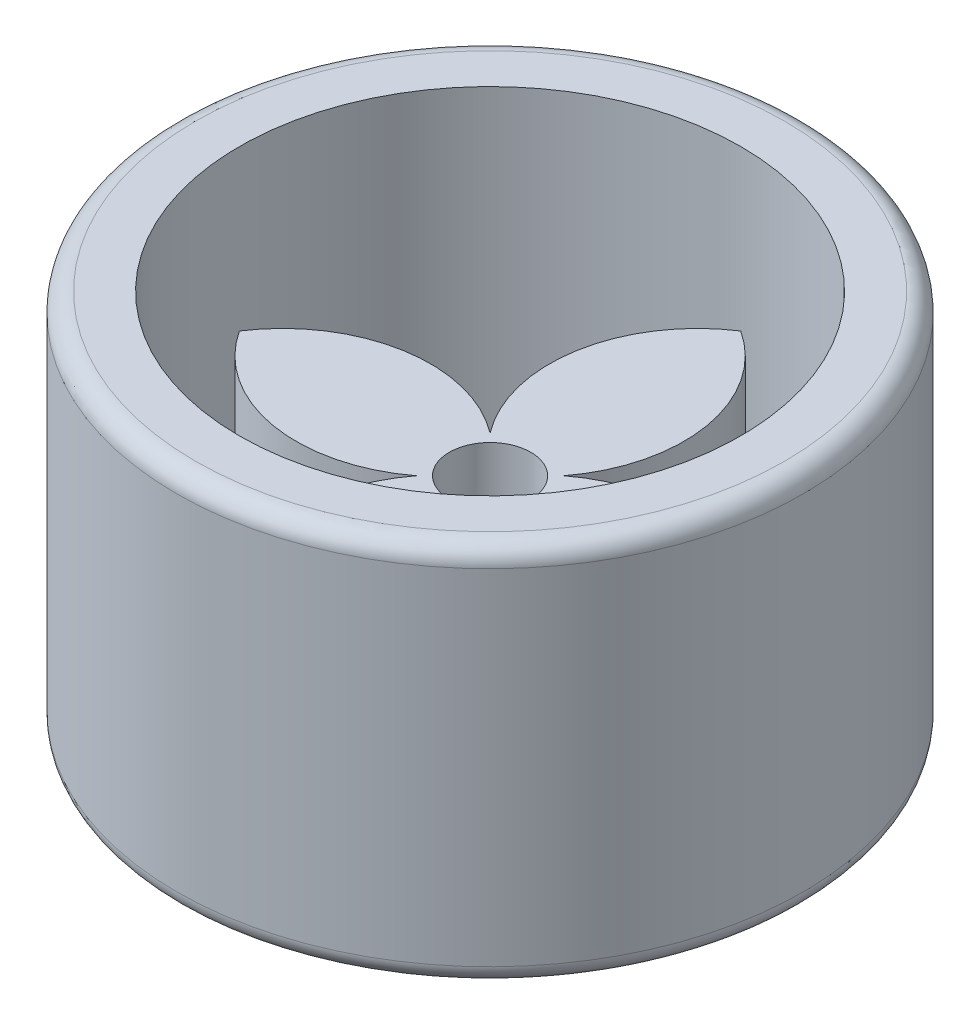
ISO-10303-21;
HEADER;
FILE_DESCRIPTION(('STEP AP214'),'2;1');
FILE_NAME('part.step','',(''),(''),'','','');
FILE_SCHEMA(('AUTOMOTIVE_DESIGN { 1 0 10303 214 1 1 1 1 }'));
ENDSEC;
DATA;
#1=APPLICATION_CONTEXT('core data for automotive mechanical design processes');
#2=APPLICATION_PROTOCOL_DEFINITION('international standard','automotive_design',2000,#1);
#3=PRODUCT_CONTEXT('',#1,'mechanical');
#4=PRODUCT('Part','Part','',(#3));
#5=PRODUCT_RELATED_PRODUCT_CATEGORY('part','',(#4));
#6=PRODUCT_DEFINITION_FORMATION('','',#4);
#7=PRODUCT_DEFINITION_CONTEXT('part definition',#1,'design');
#8=PRODUCT_DEFINITION('design','',#6,#7);
#9=PRODUCT_DEFINITION_SHAPE('','',#8);
#10=(LENGTH_UNIT() NAMED_UNIT(*) SI_UNIT(.MILLI.,.METRE.));
#11=(NAMED_UNIT(*) PLANE_ANGLE_UNIT() SI_UNIT($,.RADIAN.));
#12=(NAMED_UNIT(*) SI_UNIT($,.STERADIAN.) SOLID_ANGLE_UNIT());
#13=UNCERTAINTY_MEASURE_WITH_UNIT(LENGTH_MEASURE(1.E-05),#10,'distance_accuracy_value','');
#14=(GEOMETRIC_REPRESENTATION_CONTEXT(3) GLOBAL_UNCERTAINTY_ASSIGNED_CONTEXT((#13)) GLOBAL_UNIT_ASSIGNED_CONTEXT((#10,
#11,#12)) REPRESENTATION_CONTEXT('',''));
#15=CARTESIAN_POINT('',(0.,0.,0.));
#16=DIRECTION('',(0.,0.,1.));
#17=DIRECTION('',(1.,0.,0.));
#18=AXIS2_PLACEMENT_3D('',#15,#16,#17);
#19=CARTESIAN_POINT('',(0.,174.137084989848,0.));
#20=DIRECTION('',(0.,-1.,0.));
#21=DIRECTION('',(0.,0.,-1.));
#22=AXIS2_PLACEMENT_3D('',#19,#20,#21);
#23=CYLINDRICAL_SURFACE('',#22,2.635);
#24=CARTESIAN_POINT('',(0.,0.,0.));
#25=DIRECTION('',(0.,1.,0.));
#26=DIRECTION('',(0.,0.,1.));
#27=AXIS2_PLACEMENT_3D('',#24,#25,#26);
#28=CIRCLE('',#27,2.635);
#29=CARTESIAN_POINT('',(0.,0.,2.635));
#30=VERTEX_POINT('',#29);
#31=EDGE_CURVE('E240',#30,#30,#28,.T.);
#32=ORIENTED_EDGE('',*,*,#31,.F.);
#33=EDGE_LOOP('',(#32));
#34=FACE_BOUND('',#33,.T.);
#35=CARTESIAN_POINT('',(0.,11.95,0.));
#36=DIRECTION('',(0.,1.,0.));
#37=DIRECTION('',(0.,0.,1.));
#38=AXIS2_PLACEMENT_3D('',#35,#36,#37);
#39=CIRCLE('',#38,2.635);
#40=CARTESIAN_POINT('',(0.,11.95,2.635));
#41=VERTEX_POINT('',#40);
#42=EDGE_CURVE('E196',#41,#41,#39,.T.);
#43=ORIENTED_EDGE('',*,*,#42,.T.);
#44=EDGE_LOOP('',(#43));
#45=FACE_BOUND('',#44,.T.);
#46=ADVANCED_FACE('F66',(#34,#45),#23,.F.);
#47=CARTESIAN_POINT('',(20.2122260111009,174.137084989848,12.8907519493418));
#48=DIRECTION('',(0.,-1.,0.));
#49=DIRECTION('',(0.,0.,-1.));
#50=AXIS2_PLACEMENT_3D('',#47,#48,#49);
#51=CYLINDRICAL_SURFACE('',#50,23.6162546830612);
#52=DIRECTION('',(0.,-1.,0.));
#53=VECTOR('',#52,1.);
#54=CARTESIAN_POINT('',(5.87703014444037,174.137084989848,-5.87703014444033));
#55=LINE('',#54,#53);
#56=CARTESIAN_POINT('',(5.87703014444037,35.5,-5.87703014444033));
#57=VERTEX_POINT('',#56);
#58=CARTESIAN_POINT('',(5.87703014444037,0.,-5.87703014444033));
#59=VERTEX_POINT('',#58);
#60=EDGE_CURVE('E267',#57,#59,#55,.T.);
#61=ORIENTED_EDGE('',*,*,#60,.F.);
#62=CARTESIAN_POINT('',(20.2122260111009,35.5,12.8907519493418));
#63=DIRECTION('',(0.,1.,0.));
#64=DIRECTION('',(0.,0.,1.));
#65=AXIS2_PLACEMENT_3D('',#62,#63,#64);
#66=CIRCLE('',#65,23.6162546830612);
#67=CARTESIAN_POINT('',(40.,35.5,0.));
#68=VERTEX_POINT('',#67);
#69=EDGE_CURVE('E235',#57,#68,#66,.F.);
#70=ORIENTED_EDGE('',*,*,#69,.T.);
#71=DIRECTION('',(0.,-1.,0.));
#72=VECTOR('',#71,1.);
#73=CARTESIAN_POINT('',(40.,174.137084989848,0.));
#74=LINE('',#73,#72);
#75=CARTESIAN_POINT('',(40.,0.,0.));
#76=VERTEX_POINT('',#75);
#77=EDGE_CURVE('E70',#68,#76,#74,.T.);
#78=ORIENTED_EDGE('',*,*,#77,.T.);
#79=CARTESIAN_POINT('',(20.2122260111009,0.,12.8907519493418));
#80=DIRECTION('',(0.,1.,0.));
#81=DIRECTION('',(0.,0.,1.));
#82=AXIS2_PLACEMENT_3D('',#79,#80,#81);
#83=CIRCLE('',#82,23.6162546830612);
#84=EDGE_CURVE('E246',#59,#76,#83,.F.);
#85=ORIENTED_EDGE('',*,*,#84,.F.);
#86=EDGE_LOOP('',(#61,#70,#78,#85));
#87=FACE_BOUND('',#86,.T.);
#88=ADVANCED_FACE('F324',(#87),#51,.T.);
#89=CARTESIAN_POINT('',(-12.8907519493418,174.137084989848,-20.2122260111009));
#90=DIRECTION('',(0.,-1.,0.));
#91=DIRECTION('',(0.,0.,-1.));
#92=AXIS2_PLACEMENT_3D('',#89,#90,#91);
#93=CYLINDRICAL_SURFACE('',#92,23.6162546830613);
#94=CARTESIAN_POINT('',(-12.8907519493418,35.5,-20.2122260111009));
#95=DIRECTION('',(0.,1.,0.));
#96=DIRECTION('',(0.,0.,1.));
#97=AXIS2_PLACEMENT_3D('',#94,#95,#96);
#98=CIRCLE('',#97,23.6162546830613);
#99=CARTESIAN_POINT('',(0.,35.5,-40.));
#100=VERTEX_POINT('',#99);
#101=EDGE_CURVE('E262',#57,#100,#98,.T.);
#102=ORIENTED_EDGE('',*,*,#101,.F.);
#103=ORIENTED_EDGE('',*,*,#60,.T.);
#104=CARTESIAN_POINT('',(-12.8907519493418,0.,-20.2122260111009));
#105=DIRECTION('',(0.,1.,0.));
#106=DIRECTION('',(0.,0.,1.));
#107=AXIS2_PLACEMENT_3D('',#104,#105,#106);
#108=CIRCLE('',#107,23.6162546830613);
#109=CARTESIAN_POINT('',(0.,0.,-40.));
#110=VERTEX_POINT('',#109);
#111=EDGE_CURVE('E263',#59,#110,#108,.T.);
#112=ORIENTED_EDGE('',*,*,#111,.T.);
#113=DIRECTION('',(0.,-1.,0.));
#114=VECTOR('',#113,1.);
#115=CARTESIAN_POINT('',(0.,174.137084989848,-40.));
#116=LINE('',#115,#114);
#117=EDGE_CURVE('E282',#100,#110,#116,.T.);
#118=ORIENTED_EDGE('',*,*,#117,.F.);
#119=EDGE_LOOP('',(#102,#103,#112,#118));
#120=FACE_BOUND('',#119,.T.);
#121=ADVANCED_FACE('F321',(#120),#93,.T.);
#122=CARTESIAN_POINT('',(12.8907519493418,174.137084989848,-20.2122260111009));
#123=DIRECTION('',(0.,-1.,0.));
#124=DIRECTION('',(0.,0.,-1.));
#125=AXIS2_PLACEMENT_3D('',#122,#123,#124);
#126=CYLINDRICAL_SURFACE('',#125,23.6162546830612);
#127=DIRECTION('',(0.,-1.,0.));
#128=VECTOR('',#127,1.);
#129=CARTESIAN_POINT('',(-5.87703014444033,174.137084989848,-5.87703014444033));
#130=LINE('',#129,#128);
#131=CARTESIAN_POINT('',(-5.87703014444033,35.5,-5.87703014444033));
#132=VERTEX_POINT('',#131);
#133=CARTESIAN_POINT('',(-5.87703014444033,0.,-5.87703014444033));
#134=VERTEX_POINT('',#133);
#135=EDGE_CURVE('E259',#132,#134,#130,.T.);
#136=ORIENTED_EDGE('',*,*,#135,.F.);
#137=CARTESIAN_POINT('',(12.8907519493418,35.5,-20.2122260111009));
#138=DIRECTION('',(0.,1.,0.));
#139=DIRECTION('',(0.,0.,1.));
#140=AXIS2_PLACEMENT_3D('',#137,#138,#139);
#141=CIRCLE('',#140,23.6162546830612);
#142=EDGE_CURVE('E266',#132,#100,#141,.F.);
#143=ORIENTED_EDGE('',*,*,#142,.T.);
#144=ORIENTED_EDGE('',*,*,#117,.T.);
#145=CARTESIAN_POINT('',(12.8907519493418,0.,-20.2122260111009));
#146=DIRECTION('',(0.,1.,0.));
#147=DIRECTION('',(0.,0.,1.));
#148=AXIS2_PLACEMENT_3D('',#145,#146,#147);
#149=CIRCLE('',#148,23.6162546830612);
#150=EDGE_CURVE('E254',#134,#110,#149,.F.);
#151=ORIENTED_EDGE('',*,*,#150,.F.);
#152=EDGE_LOOP('',(#136,#143,#144,#151));
#153=FACE_BOUND('',#152,.T.);
#154=ADVANCED_FACE('F317',(#153),#126,.T.);
#155=CARTESIAN_POINT('',(-20.2122260111009,174.137084989848,12.8907519493418));
#156=DIRECTION('',(0.,-1.,0.));
#157=DIRECTION('',(0.,0.,-1.));
#158=AXIS2_PLACEMENT_3D('',#155,#156,#157);
#159=CYLINDRICAL_SURFACE('',#158,23.6162546830612);
#160=CARTESIAN_POINT('',(-20.2122260111009,35.5,12.8907519493418));
#161=DIRECTION('',(0.,1.,0.));
#162=DIRECTION('',(0.,0.,1.));
#163=AXIS2_PLACEMENT_3D('',#160,#161,#162);
#164=CIRCLE('',#163,23.6162546830612);
#165=CARTESIAN_POINT('',(-40.,35.5,0.));
#166=VERTEX_POINT('',#165);
#167=EDGE_CURVE('E276',#132,#166,#164,.T.);
#168=ORIENTED_EDGE('',*,*,#167,.F.);
#169=ORIENTED_EDGE('',*,*,#135,.T.);
#170=CARTESIAN_POINT('',(-20.2122260111009,0.,12.8907519493418));
#171=DIRECTION('',(0.,1.,0.));
#172=DIRECTION('',(0.,0.,1.));
#173=AXIS2_PLACEMENT_3D('',#170,#171,#172);
#174=CIRCLE('',#173,23.6162546830612);
#175=CARTESIAN_POINT('',(-40.,0.,0.));
#176=VERTEX_POINT('',#175);
#177=EDGE_CURVE('E255',#134,#176,#174,.T.);
#178=ORIENTED_EDGE('',*,*,#177,.T.);
#179=DIRECTION('',(0.,-1.,0.));
#180=VECTOR('',#179,1.);
#181=CARTESIAN_POINT('',(-40.,174.137084989848,0.));
#182=LINE('',#181,#180);
#183=EDGE_CURVE('E278',#166,#176,#182,.T.);
#184=ORIENTED_EDGE('',*,*,#183,.F.);
#185=EDGE_LOOP('',(#168,#169,#178,#184));
#186=FACE_BOUND('',#185,.T.);
#187=ADVANCED_FACE('F313',(#186),#159,.T.);
#188=CARTESIAN_POINT('',(-20.2122260111009,174.137084989848,-12.8907519493418));
#189=DIRECTION('',(0.,-1.,0.));
#190=DIRECTION('',(0.,0.,-1.));
#191=AXIS2_PLACEMENT_3D('',#188,#189,#190);
#192=CYLINDRICAL_SURFACE('',#191,23.6162546830612);
#193=DIRECTION('',(0.,-1.,0.));
#194=VECTOR('',#193,1.);
#195=CARTESIAN_POINT('',(-5.87703014444032,174.137084989848,5.87703014444034));
#196=LINE('',#195,#194);
#197=CARTESIAN_POINT('',(-5.87703014444032,35.5,5.87703014444034));
#198=VERTEX_POINT('',#197);
#199=CARTESIAN_POINT('',(-5.87703014444032,0.,5.87703014444034));
#200=VERTEX_POINT('',#199);
#201=EDGE_CURVE('E251',#198,#200,#196,.T.);
#202=ORIENTED_EDGE('',*,*,#201,.F.);
#203=CARTESIAN_POINT('',(-20.2122260111009,35.5,-12.8907519493418));
#204=DIRECTION('',(0.,1.,0.));
#205=DIRECTION('',(0.,0.,1.));
#206=AXIS2_PLACEMENT_3D('',#203,#204,#205);
#207=CIRCLE('',#206,23.6162546830612);
#208=EDGE_CURVE('E258',#198,#166,#207,.F.);
#209=ORIENTED_EDGE('',*,*,#208,.T.);
#210=ORIENTED_EDGE('',*,*,#183,.T.);
#211=CARTESIAN_POINT('',(-20.2122260111009,0.,-12.8907519493418));
#212=DIRECTION('',(0.,1.,0.));
#213=DIRECTION('',(0.,0.,1.));
#214=AXIS2_PLACEMENT_3D('',#211,#212,#213);
#215=CIRCLE('',#214,23.6162546830612);
#216=EDGE_CURVE('E245',#200,#176,#215,.F.);
#217=ORIENTED_EDGE('',*,*,#216,.F.);
#218=EDGE_LOOP('',(#202,#209,#210,#217));
#219=FACE_BOUND('',#218,.T.);
#220=ADVANCED_FACE('F309',(#219),#192,.T.);
#221=CARTESIAN_POINT('',(12.8907519493419,174.137084989848,20.2122260111009));
#222=DIRECTION('',(0.,-1.,0.));
#223=DIRECTION('',(0.,0.,-1.));
#224=AXIS2_PLACEMENT_3D('',#221,#222,#223);
#225=CYLINDRICAL_SURFACE('',#224,23.6162546830612);
#226=CARTESIAN_POINT('',(12.8907519493419,35.5,20.2122260111009));
#227=DIRECTION('',(0.,1.,0.));
#228=DIRECTION('',(0.,0.,1.));
#229=AXIS2_PLACEMENT_3D('',#226,#227,#228);
#230=CIRCLE('',#229,23.6162546830612);
#231=CARTESIAN_POINT('',(0.,35.5,40.));
#232=VERTEX_POINT('',#231);
#233=EDGE_CURVE('E75',#198,#232,#230,.T.);
#234=ORIENTED_EDGE('',*,*,#233,.F.);
#235=ORIENTED_EDGE('',*,*,#201,.T.);
#236=CARTESIAN_POINT('',(12.8907519493419,0.,20.2122260111009));
#237=DIRECTION('',(0.,1.,0.));
#238=DIRECTION('',(0.,0.,1.));
#239=AXIS2_PLACEMENT_3D('',#236,#237,#238);
#240=CIRCLE('',#239,23.6162546830612);
#241=CARTESIAN_POINT('',(0.,0.,40.));
#242=VERTEX_POINT('',#241);
#243=EDGE_CURVE('E247',#200,#242,#240,.T.);
#244=ORIENTED_EDGE('',*,*,#243,.T.);
#245=DIRECTION('',(0.,-1.,0.));
#246=VECTOR('',#245,1.);
#247=CARTESIAN_POINT('',(0.,174.137084989848,40.));
#248=LINE('',#247,#246);
#249=EDGE_CURVE('E273',#232,#242,#248,.T.);
#250=ORIENTED_EDGE('',*,*,#249,.F.);
#251=EDGE_LOOP('',(#234,#235,#244,#250));
#252=FACE_BOUND('',#251,.T.);
#253=ADVANCED_FACE('F304',(#252),#225,.T.);
#254=CARTESIAN_POINT('',(-12.8907519493418,174.137084989848,20.2122260111009));
#255=DIRECTION('',(0.,-1.,0.));
#256=DIRECTION('',(0.,0.,-1.));
#257=AXIS2_PLACEMENT_3D('',#254,#255,#256);
#258=CYLINDRICAL_SURFACE('',#257,23.6162546830612);
#259=DIRECTION('',(0.,-1.,0.));
#260=VECTOR('',#259,1.);
#261=CARTESIAN_POINT('',(5.87703014444035,174.137084989848,5.87703014444033));
#262=LINE('',#261,#260);
#263=CARTESIAN_POINT('',(5.87703014444035,35.5,5.87703014444033));
#264=VERTEX_POINT('',#263);
#265=CARTESIAN_POINT('',(5.87703014444035,0.,5.87703014444033));
#266=VERTEX_POINT('',#265);
#267=EDGE_CURVE('E241',#264,#266,#262,.T.);
#268=ORIENTED_EDGE('',*,*,#267,.F.);
#269=CARTESIAN_POINT('',(-12.8907519493418,35.5,20.2122260111009));
#270=DIRECTION('',(0.,1.,0.));
#271=DIRECTION('',(0.,0.,1.));
#272=AXIS2_PLACEMENT_3D('',#269,#270,#271);
#273=CIRCLE('',#272,23.6162546830612);
#274=EDGE_CURVE('E250',#264,#232,#273,.F.);
#275=ORIENTED_EDGE('',*,*,#274,.T.);
#276=ORIENTED_EDGE('',*,*,#249,.T.);
#277=CARTESIAN_POINT('',(-12.8907519493418,0.,20.2122260111009));
#278=DIRECTION('',(0.,1.,0.));
#279=DIRECTION('',(0.,0.,1.));
#280=AXIS2_PLACEMENT_3D('',#277,#278,#279);
#281=CIRCLE('',#280,23.6162546830612);
#282=EDGE_CURVE('E242',#266,#242,#281,.F.);
#283=ORIENTED_EDGE('',*,*,#282,.F.);
#284=EDGE_LOOP('',(#268,#275,#276,#283));
#285=FACE_BOUND('',#284,.T.);
#286=ADVANCED_FACE('F301',(#285),#258,.T.);
#287=CARTESIAN_POINT('',(20.2122260111009,174.137084989848,-12.8907519493418));
#288=DIRECTION('',(0.,-1.,0.));
#289=DIRECTION('',(0.,0.,-1.));
#290=AXIS2_PLACEMENT_3D('',#287,#288,#289);
#291=CYLINDRICAL_SURFACE('',#290,23.6162546830612);
#292=CARTESIAN_POINT('',(20.2122260111009,35.5,-12.8907519493418));
#293=DIRECTION('',(0.,1.,0.));
#294=DIRECTION('',(0.,0.,1.));
#295=AXIS2_PLACEMENT_3D('',#292,#293,#294);
#296=CIRCLE('',#295,23.6162546830612);
#297=EDGE_CURVE('E13',#264,#68,#296,.T.);
#298=ORIENTED_EDGE('',*,*,#297,.F.);
#299=ORIENTED_EDGE('',*,*,#267,.T.);
#300=CARTESIAN_POINT('',(20.2122260111009,0.,-12.8907519493418));
#301=DIRECTION('',(0.,1.,0.));
#302=DIRECTION('',(0.,0.,1.));
#303=AXIS2_PLACEMENT_3D('',#300,#301,#302);
#304=CIRCLE('',#303,23.6162546830612);
#305=EDGE_CURVE('E238',#266,#76,#304,.T.);
#306=ORIENTED_EDGE('',*,*,#305,.T.);
#307=ORIENTED_EDGE('',*,*,#77,.F.);
#308=EDGE_LOOP('',(#298,#299,#306,#307));
#309=FACE_BOUND('',#308,.T.);
#310=ADVANCED_FACE('F292',(#309),#291,.T.);
#311=CARTESIAN_POINT('',(0.,0.,0.));
#312=DIRECTION('',(0.,1.,0.));
#313=DIRECTION('',(0.,0.,1.));
#314=AXIS2_PLACEMENT_3D('',#311,#312,#313);
#315=PLANE('',#314);
#316=ORIENTED_EDGE('',*,*,#31,.T.);
#317=EDGE_LOOP('',(#316));
#318=FACE_BOUND('',#317,.T.);
#319=ORIENTED_EDGE('',*,*,#84,.T.);
#320=ORIENTED_EDGE('',*,*,#305,.F.);
#321=ORIENTED_EDGE('',*,*,#282,.T.);
#322=ORIENTED_EDGE('',*,*,#243,.F.);
#323=ORIENTED_EDGE('',*,*,#216,.T.);
#324=ORIENTED_EDGE('',*,*,#177,.F.);
#325=ORIENTED_EDGE('',*,*,#150,.T.);
#326=ORIENTED_EDGE('',*,*,#111,.F.);
#327=EDGE_LOOP('',(#319,#320,#321,#322,#323,#324,#325,#326));
#328=FACE_BOUND('',#327,.T.);
#329=ADVANCED_FACE('F297',(#318,#328),#315,.F.);
#330=CARTESIAN_POINT('',(0.,35.5,0.));
#331=DIRECTION('',(0.,1.,0.));
#332=DIRECTION('',(0.,0.,1.));
#333=AXIS2_PLACEMENT_3D('',#330,#331,#332);
#334=PLANE('',#333);
#335=CARTESIAN_POINT('',(0.,35.5,0.));
#336=DIRECTION('',(0.,1.,0.));
#337=DIRECTION('',(0.,0.,1.));
#338=AXIS2_PLACEMENT_3D('',#335,#336,#337);
#339=CIRCLE('',#338,6.5);
#340=CARTESIAN_POINT('',(0.,35.5,6.5));
#341=VERTEX_POINT('',#340);
#342=EDGE_CURVE('E229',#341,#341,#339,.T.);
#343=ORIENTED_EDGE('',*,*,#342,.F.);
#344=EDGE_LOOP('',(#343));
#345=FACE_BOUND('',#344,.T.);
#346=ORIENTED_EDGE('',*,*,#69,.F.);
#347=ORIENTED_EDGE('',*,*,#101,.T.);
#348=ORIENTED_EDGE('',*,*,#142,.F.);
#349=ORIENTED_EDGE('',*,*,#167,.T.);
#350=ORIENTED_EDGE('',*,*,#208,.F.);
#351=ORIENTED_EDGE('',*,*,#233,.T.);
#352=ORIENTED_EDGE('',*,*,#274,.F.);
#353=ORIENTED_EDGE('',*,*,#297,.T.);
#354=EDGE_LOOP('',(#346,#347,#348,#349,#350,#351,#352,#353));
#355=FACE_BOUND('',#354,.T.);
#356=ADVANCED_FACE('F68',(#345,#355),#334,.T.);
#357=CARTESIAN_POINT('',(0.,20.9,0.));
#358=DIRECTION('',(0.,1.,0.));
#359=DIRECTION('',(0.,0.,1.));
#360=AXIS2_PLACEMENT_3D('',#357,#358,#359);
#361=CYLINDRICAL_SURFACE('',#360,6.5);
#362=CARTESIAN_POINT('',(0.,20.9,0.));
#363=DIRECTION('',(0.,1.,0.));
#364=DIRECTION('',(0.,0.,1.));
#365=AXIS2_PLACEMENT_3D('',#362,#363,#364);
#366=CIRCLE('',#365,6.5);
#367=CARTESIAN_POINT('',(0.,20.9,6.5));
#368=VERTEX_POINT('',#367);
#369=EDGE_CURVE('E232',#368,#368,#366,.T.);
#370=ORIENTED_EDGE('',*,*,#369,.F.);
#371=EDGE_LOOP('',(#370));
#372=FACE_BOUND('',#371,.T.);
#373=ORIENTED_EDGE('',*,*,#342,.T.);
#374=EDGE_LOOP('',(#373));
#375=FACE_BOUND('',#374,.T.);
#376=ADVANCED_FACE('F328',(#372,#375),#361,.F.);
#377=CARTESIAN_POINT('',(0.,20.9,0.));
#378=DIRECTION('',(0.,1.,0.));
#379=DIRECTION('',(0.,0.,1.));
#380=AXIS2_PLACEMENT_3D('',#377,#378,#379);
#381=PLANE('',#380);
#382=CARTESIAN_POINT('',(0.,20.9,0.));
#383=DIRECTION('',(0.,1.,0.));
#384=DIRECTION('',(0.,0.,1.));
#385=AXIS2_PLACEMENT_3D('',#382,#383,#384);
#386=CIRCLE('',#385,4.95);
#387=CARTESIAN_POINT('',(0.,20.9,4.95));
#388=VERTEX_POINT('',#387);
#389=EDGE_CURVE('E218',#388,#388,#386,.T.);
#390=ORIENTED_EDGE('',*,*,#389,.F.);
#391=EDGE_LOOP('',(#390));
#392=FACE_BOUND('',#391,.T.);
#393=ORIENTED_EDGE('',*,*,#369,.T.);
#394=EDGE_LOOP('',(#393));
#395=FACE_BOUND('',#394,.T.);
#396=ADVANCED_FACE('F334',(#392,#395),#381,.T.);
#397=CARTESIAN_POINT('',(0.,19.9,0.));
#398=DIRECTION('',(0.,1.,0.));
#399=DIRECTION('',(0.,0.,1.));
#400=AXIS2_PLACEMENT_3D('',#397,#398,#399);
#401=CYLINDRICAL_SURFACE('',#400,4.95);
#402=CARTESIAN_POINT('',(0.,19.9,0.));
#403=DIRECTION('',(0.,1.,0.));
#404=DIRECTION('',(0.,0.,1.));
#405=AXIS2_PLACEMENT_3D('',#402,#403,#404);
#406=CIRCLE('',#405,4.95);
#407=CARTESIAN_POINT('',(0.,19.9,4.95));
#408=VERTEX_POINT('',#407);
#409=EDGE_CURVE('E226',#408,#408,#406,.T.);
#410=ORIENTED_EDGE('',*,*,#409,.F.);
#411=EDGE_LOOP('',(#410));
#412=FACE_BOUND('',#411,.T.);
#413=ORIENTED_EDGE('',*,*,#389,.T.);
#414=EDGE_LOOP('',(#413));
#415=FACE_BOUND('',#414,.T.);
#416=ADVANCED_FACE('F413',(#412,#415),#401,.F.);
#417=CARTESIAN_POINT('',(0.,19.9,0.));
#418=DIRECTION('',(0.,1.,0.));
#419=DIRECTION('',(0.,0.,1.));
#420=AXIS2_PLACEMENT_3D('',#417,#418,#419);
#421=PLANE('',#420);
#422=DIRECTION('',(0.5,0.,-0.866025403784438));
#423=VECTOR('',#422,1.);
#424=CARTESIAN_POINT('',(3.46410161513775,19.9,2.));
#425=LINE('',#424,#423);
#426=CARTESIAN_POINT('',(2.3094010767585,19.9,4.));
#427=VERTEX_POINT('',#426);
#428=CARTESIAN_POINT('',(4.61880215351701,19.9,0.));
#429=VERTEX_POINT('',#428);
#430=EDGE_CURVE('E83',#427,#429,#425,.T.);
#431=ORIENTED_EDGE('',*,*,#430,.F.);
#432=DIRECTION('',(1.,0.,0.));
#433=VECTOR('',#432,1.);
#434=CARTESIAN_POINT('',(0.,19.9,4.));
#435=LINE('',#434,#433);
#436=CARTESIAN_POINT('',(-2.3094010767585,19.9,4.));
#437=VERTEX_POINT('',#436);
#438=EDGE_CURVE('E190',#437,#427,#435,.T.);
#439=ORIENTED_EDGE('',*,*,#438,.F.);
#440=DIRECTION('',(0.5,0.,0.866025403784439));
#441=VECTOR('',#440,1.);
#442=CARTESIAN_POINT('',(-3.46410161513776,19.9,2.));
#443=LINE('',#442,#441);
#444=CARTESIAN_POINT('',(-4.61880215351701,19.9,0.));
#445=VERTEX_POINT('',#444);
#446=EDGE_CURVE('E193',#445,#437,#443,.T.);
#447=ORIENTED_EDGE('',*,*,#446,.F.);
#448=DIRECTION('',(-0.5,0.,0.866025403784439));
#449=VECTOR('',#448,1.);
#450=CARTESIAN_POINT('',(-3.46410161513776,19.9,-2.));
#451=LINE('',#450,#449);
#452=CARTESIAN_POINT('',(-2.3094010767585,19.9,-4.));
#453=VERTEX_POINT('',#452);
#454=EDGE_CURVE('E211',#453,#445,#451,.T.);
#455=ORIENTED_EDGE('',*,*,#454,.F.);
#456=DIRECTION('',(-1.,0.,0.));
#457=VECTOR('',#456,1.);
#458=CARTESIAN_POINT('',(0.,19.9,-4.));
#459=LINE('',#458,#457);
#460=CARTESIAN_POINT('',(2.3094010767585,19.9,-4.));
#461=VERTEX_POINT('',#460);
#462=EDGE_CURVE('E208',#461,#453,#459,.T.);
#463=ORIENTED_EDGE('',*,*,#462,.F.);
#464=DIRECTION('',(-0.5,0.,-0.866025403784438));
#465=VECTOR('',#464,1.);
#466=CARTESIAN_POINT('',(3.46410161513775,19.9,-2.));
#467=LINE('',#466,#465);
#468=EDGE_CURVE('E206',#429,#461,#467,.T.);
#469=ORIENTED_EDGE('',*,*,#468,.F.);
#470=EDGE_LOOP('',(#431,#439,#447,#455,#463,#469));
#471=FACE_BOUND('',#470,.T.);
#472=ORIENTED_EDGE('',*,*,#409,.T.);
#473=EDGE_LOOP('',(#472));
#474=FACE_BOUND('',#473,.T.);
#475=ADVANCED_FACE('F422',(#471,#474),#421,.T.);
#476=CARTESIAN_POINT('',(3.46410161513775,11.95,2.));
#477=DIRECTION('',(0.866025403784438,0.,0.5));
#478=DIRECTION('',(0.5,0.,-0.866025403784438));
#479=AXIS2_PLACEMENT_3D('',#476,#477,#478);
#480=PLANE('',#479);
#481=ORIENTED_EDGE('',*,*,#430,.T.);
#482=DIRECTION('',(0.,1.,0.));
#483=VECTOR('',#482,1.);
#484=CARTESIAN_POINT('',(4.61880215351701,11.95,0.));
#485=LINE('',#484,#483);
#486=CARTESIAN_POINT('',(4.61880215351701,11.95,0.));
#487=VERTEX_POINT('',#486);
#488=EDGE_CURVE('E167',#487,#429,#485,.T.);
#489=ORIENTED_EDGE('',*,*,#488,.F.);
#490=DIRECTION('',(0.5,0.,-0.866025403784438));
#491=VECTOR('',#490,1.);
#492=CARTESIAN_POINT('',(3.46410161513775,11.95,2.));
#493=LINE('',#492,#491);
#494=CARTESIAN_POINT('',(2.3094010767585,11.95,4.));
#495=VERTEX_POINT('',#494);
#496=EDGE_CURVE('E171',#495,#487,#493,.T.);
#497=ORIENTED_EDGE('',*,*,#496,.F.);
#498=DIRECTION('',(0.,1.,0.));
#499=VECTOR('',#498,1.);
#500=CARTESIAN_POINT('',(2.3094010767585,11.95,4.));
#501=LINE('',#500,#499);
#502=EDGE_CURVE('E216',#495,#427,#501,.T.);
#503=ORIENTED_EDGE('',*,*,#502,.T.);
#504=EDGE_LOOP('',(#481,#489,#497,#503));
#505=FACE_BOUND('',#504,.T.);
#506=ADVANCED_FACE('F169',(#505),#480,.F.);
#507=CARTESIAN_POINT('',(0.,11.95,4.));
#508=DIRECTION('',(0.,0.,1.));
#509=DIRECTION('',(1.,0.,0.));
#510=AXIS2_PLACEMENT_3D('',#507,#508,#509);
#511=PLANE('',#510);
#512=ORIENTED_EDGE('',*,*,#438,.T.);
#513=ORIENTED_EDGE('',*,*,#502,.F.);
#514=DIRECTION('',(1.,0.,0.));
#515=VECTOR('',#514,1.);
#516=CARTESIAN_POINT('',(0.,11.95,4.));
#517=LINE('',#516,#515);
#518=CARTESIAN_POINT('',(-2.3094010767585,11.95,4.));
#519=VERTEX_POINT('',#518);
#520=EDGE_CURVE('E177',#519,#495,#517,.T.);
#521=ORIENTED_EDGE('',*,*,#520,.F.);
#522=DIRECTION('',(0.,1.,0.));
#523=VECTOR('',#522,1.);
#524=CARTESIAN_POINT('',(-2.3094010767585,11.95,4.));
#525=LINE('',#524,#523);
#526=EDGE_CURVE('E219',#519,#437,#525,.T.);
#527=ORIENTED_EDGE('',*,*,#526,.T.);
#528=EDGE_LOOP('',(#512,#513,#521,#527));
#529=FACE_BOUND('',#528,.T.);
#530=ADVANCED_FACE('F446',(#529),#511,.F.);
#531=CARTESIAN_POINT('',(-3.46410161513776,11.95,2.));
#532=DIRECTION('',(-0.866025403784439,0.,0.5));
#533=DIRECTION('',(0.5,0.,0.866025403784439));
#534=AXIS2_PLACEMENT_3D('',#531,#532,#533);
#535=PLANE('',#534);
#536=ORIENTED_EDGE('',*,*,#446,.T.);
#537=ORIENTED_EDGE('',*,*,#526,.F.);
#538=DIRECTION('',(0.5,0.,0.866025403784439));
#539=VECTOR('',#538,1.);
#540=CARTESIAN_POINT('',(-3.46410161513776,11.95,2.));
#541=LINE('',#540,#539);
#542=CARTESIAN_POINT('',(-4.61880215351701,11.95,0.));
#543=VERTEX_POINT('',#542);
#544=EDGE_CURVE('E202',#543,#519,#541,.T.);
#545=ORIENTED_EDGE('',*,*,#544,.F.);
#546=DIRECTION('',(0.,1.,0.));
#547=VECTOR('',#546,1.);
#548=CARTESIAN_POINT('',(-4.61880215351701,11.95,0.));
#549=LINE('',#548,#547);
#550=EDGE_CURVE('E221',#543,#445,#549,.T.);
#551=ORIENTED_EDGE('',*,*,#550,.T.);
#552=EDGE_LOOP('',(#536,#537,#545,#551));
#553=FACE_BOUND('',#552,.T.);
#554=ADVANCED_FACE('F455',(#553),#535,.F.);
#555=CARTESIAN_POINT('',(-3.46410161513776,11.95,-2.));
#556=DIRECTION('',(-0.866025403784439,0.,-0.5));
#557=DIRECTION('',(-0.5,0.,0.866025403784439));
#558=AXIS2_PLACEMENT_3D('',#555,#556,#557);
#559=PLANE('',#558);
#560=ORIENTED_EDGE('',*,*,#454,.T.);
#561=ORIENTED_EDGE('',*,*,#550,.F.);
#562=DIRECTION('',(-0.5,0.,0.866025403784439));
#563=VECTOR('',#562,1.);
#564=CARTESIAN_POINT('',(-3.46410161513776,11.95,-2.));
#565=LINE('',#564,#563);
#566=CARTESIAN_POINT('',(-2.3094010767585,11.95,-4.));
#567=VERTEX_POINT('',#566);
#568=EDGE_CURVE('E199',#567,#543,#565,.T.);
#569=ORIENTED_EDGE('',*,*,#568,.F.);
#570=DIRECTION('',(0.,1.,0.));
#571=VECTOR('',#570,1.);
#572=CARTESIAN_POINT('',(-2.3094010767585,11.95,-4.));
#573=LINE('',#572,#571);
#574=EDGE_CURVE('E223',#567,#453,#573,.T.);
#575=ORIENTED_EDGE('',*,*,#574,.T.);
#576=EDGE_LOOP('',(#560,#561,#569,#575));
#577=FACE_BOUND('',#576,.T.);
#578=ADVANCED_FACE('F465',(#577),#559,.F.);
#579=CARTESIAN_POINT('',(0.,11.95,-4.));
#580=DIRECTION('',(0.,0.,-1.));
#581=DIRECTION('',(-1.,0.,0.));
#582=AXIS2_PLACEMENT_3D('',#579,#580,#581);
#583=PLANE('',#582);
#584=ORIENTED_EDGE('',*,*,#462,.T.);
#585=ORIENTED_EDGE('',*,*,#574,.F.);
#586=DIRECTION('',(-1.,0.,0.));
#587=VECTOR('',#586,1.);
#588=CARTESIAN_POINT('',(0.,11.95,-4.));
#589=LINE('',#588,#587);
#590=CARTESIAN_POINT('',(2.3094010767585,11.95,-4.));
#591=VERTEX_POINT('',#590);
#592=EDGE_CURVE('E185',#591,#567,#589,.T.);
#593=ORIENTED_EDGE('',*,*,#592,.F.);
#594=DIRECTION('',(0.,1.,0.));
#595=VECTOR('',#594,1.);
#596=CARTESIAN_POINT('',(2.3094010767585,11.95,-4.));
#597=LINE('',#596,#595);
#598=EDGE_CURVE('E176',#591,#461,#597,.T.);
#599=ORIENTED_EDGE('',*,*,#598,.T.);
#600=EDGE_LOOP('',(#584,#585,#593,#599));
#601=FACE_BOUND('',#600,.T.);
#602=ADVANCED_FACE('F475',(#601),#583,.F.);
#603=CARTESIAN_POINT('',(3.46410161513775,11.95,-2.));
#604=DIRECTION('',(0.866025403784438,0.,-0.5));
#605=DIRECTION('',(-0.5,0.,-0.866025403784438));
#606=AXIS2_PLACEMENT_3D('',#603,#604,#605);
#607=PLANE('',#606);
#608=ORIENTED_EDGE('',*,*,#468,.T.);
#609=ORIENTED_EDGE('',*,*,#598,.F.);
#610=DIRECTION('',(-0.5,0.,-0.866025403784438));
#611=VECTOR('',#610,1.);
#612=CARTESIAN_POINT('',(3.46410161513775,11.95,-2.));
#613=LINE('',#612,#611);
#614=EDGE_CURVE('E180',#487,#591,#613,.T.);
#615=ORIENTED_EDGE('',*,*,#614,.F.);
#616=ORIENTED_EDGE('',*,*,#488,.T.);
#617=EDGE_LOOP('',(#608,#609,#615,#616));
#618=FACE_BOUND('',#617,.T.);
#619=ADVANCED_FACE('F181',(#618),#607,.F.);
#620=CARTESIAN_POINT('',(0.,11.95,0.));
#621=DIRECTION('',(0.,1.,0.));
#622=DIRECTION('',(0.,0.,1.));
#623=AXIS2_PLACEMENT_3D('',#620,#621,#622);
#624=PLANE('',#623);
#625=ORIENTED_EDGE('',*,*,#42,.F.);
#626=EDGE_LOOP('',(#625));
#627=FACE_BOUND('',#626,.T.);
#628=ORIENTED_EDGE('',*,*,#496,.T.);
#629=ORIENTED_EDGE('',*,*,#614,.T.);
#630=ORIENTED_EDGE('',*,*,#592,.T.);
#631=ORIENTED_EDGE('',*,*,#568,.T.);
#632=ORIENTED_EDGE('',*,*,#544,.T.);
#633=ORIENTED_EDGE('',*,*,#520,.T.);
#634=EDGE_LOOP('',(#628,#629,#630,#631,#632,#633));
#635=FACE_BOUND('',#634,.T.);
#636=ADVANCED_FACE('F187',(#627,#635),#624,.T.);
#637=CLOSED_SHELL('',(#46,#88,#121,#154,#187,#220,#253,#286,#310,#329,#356,#376,#396,#416,#475,
#506,#530,#554,#578,#602,#619,#636));
#638=MANIFOLD_SOLID_BREP('B2',#637);
#639=CARTESIAN_POINT('',(0.,61.,0.));
#640=DIRECTION('',(0.,-1.,0.));
#641=DIRECTION('',(0.,0.,-1.));
#642=AXIS2_PLACEMENT_3D('',#639,#640,#641);
#643=CYLINDRICAL_SURFACE('',#642,40.);
#644=CARTESIAN_POINT('',(0.,61.,0.));
#645=DIRECTION('',(0.,1.,0.));
#646=DIRECTION('',(0.,0.,1.));
#647=AXIS2_PLACEMENT_3D('',#644,#645,#646);
#648=CIRCLE('',#647,40.);
#649=CARTESIAN_POINT('',(0.,61.,40.));
#650=VERTEX_POINT('',#649);
#651=EDGE_CURVE('E562',#650,#650,#648,.T.);
#652=ORIENTED_EDGE('',*,*,#651,.T.);
#653=EDGE_LOOP('',(#652));
#654=FACE_BOUND('',#653,.T.);
#655=CARTESIAN_POINT('',(0.,0.,0.));
#656=DIRECTION('',(0.,1.,0.));
#657=DIRECTION('',(0.,0.,1.));
#658=AXIS2_PLACEMENT_3D('',#655,#656,#657);
#659=CIRCLE('',#658,40.);
#660=CARTESIAN_POINT('',(0.,0.,40.));
#661=VERTEX_POINT('',#660);
#662=EDGE_CURVE('E563',#661,#661,#659,.T.);
#663=ORIENTED_EDGE('',*,*,#662,.F.);
#664=EDGE_LOOP('',(#663));
#665=FACE_BOUND('',#664,.T.);
#666=ADVANCED_FACE('F542',(#654,#665),#643,.F.);
#667=CARTESIAN_POINT('',(0.,61.,0.));
#668=DIRECTION('',(0.,-1.,0.));
#669=DIRECTION('',(0.,0.,-1.));
#670=AXIS2_PLACEMENT_3D('',#667,#668,#669);
#671=CYLINDRICAL_SURFACE('',#670,50.);
#672=CARTESIAN_POINT('',(0.,58.,0.));
#673=DIRECTION('',(0.,1.,0.));
#674=DIRECTION('',(0.,0.,1.));
#675=AXIS2_PLACEMENT_3D('',#672,#673,#674);
#676=CIRCLE('',#675,50.);
#677=CARTESIAN_POINT('',(0.,58.,50.));
#678=VERTEX_POINT('',#677);
#679=EDGE_CURVE('E549',#678,#678,#676,.F.);
#680=ORIENTED_EDGE('',*,*,#679,.T.);
#681=EDGE_LOOP('',(#680));
#682=FACE_BOUND('',#681,.T.);
#683=CARTESIAN_POINT('',(0.,3.,0.));
#684=DIRECTION('',(0.,1.,0.));
#685=DIRECTION('',(0.,0.,1.));
#686=AXIS2_PLACEMENT_3D('',#683,#684,#685);
#687=CIRCLE('',#686,50.);
#688=CARTESIAN_POINT('',(0.,3.,50.));
#689=VERTEX_POINT('',#688);
#690=EDGE_CURVE('E553',#689,#689,#687,.T.);
#691=ORIENTED_EDGE('',*,*,#690,.T.);
#692=EDGE_LOOP('',(#691));
#693=FACE_BOUND('',#692,.T.);
#694=ADVANCED_FACE('F574',(#682,#693),#671,.T.);
#695=CARTESIAN_POINT('',(0.,61.,0.));
#696=DIRECTION('',(0.,1.,0.));
#697=DIRECTION('',(0.,0.,1.));
#698=AXIS2_PLACEMENT_3D('',#695,#696,#697);
#699=PLANE('',#698);
#700=CARTESIAN_POINT('',(0.,61.,0.));
#701=DIRECTION('',(0.,1.,0.));
#702=DIRECTION('',(0.,0.,1.));
#703=AXIS2_PLACEMENT_3D('',#700,#701,#702);
#704=CIRCLE('',#703,47.);
#705=CARTESIAN_POINT('',(0.,61.,47.));
#706=VERTEX_POINT('',#705);
#707=EDGE_CURVE('E557',#706,#706,#704,.T.);
#708=ORIENTED_EDGE('',*,*,#707,.T.);
#709=EDGE_LOOP('',(#708));
#710=FACE_BOUND('',#709,.T.);
#711=ORIENTED_EDGE('',*,*,#651,.F.);
#712=EDGE_LOOP('',(#711));
#713=FACE_BOUND('',#712,.T.);
#714=ADVANCED_FACE('F571',(#710,#713),#699,.T.);
#715=CARTESIAN_POINT('',(0.,0.,0.));
#716=DIRECTION('',(0.,1.,0.));
#717=DIRECTION('',(0.,0.,1.));
#718=AXIS2_PLACEMENT_3D('',#715,#716,#717);
#719=PLANE('',#718);
#720=CARTESIAN_POINT('',(0.,0.,0.));
#721=DIRECTION('',(0.,1.,0.));
#722=DIRECTION('',(0.,0.,1.));
#723=AXIS2_PLACEMENT_3D('',#720,#721,#722);
#724=CIRCLE('',#723,47.);
#725=CARTESIAN_POINT('',(0.,0.,47.));
#726=VERTEX_POINT('',#725);
#727=EDGE_CURVE('E65',#726,#726,#724,.F.);
#728=ORIENTED_EDGE('',*,*,#727,.T.);
#729=EDGE_LOOP('',(#728));
#730=FACE_BOUND('',#729,.T.);
#731=ORIENTED_EDGE('',*,*,#662,.T.);
#732=EDGE_LOOP('',(#731));
#733=FACE_BOUND('',#732,.T.);
#734=ADVANCED_FACE('F573',(#730,#733),#719,.F.);
#735=CARTESIAN_POINT('',(0.,58.,0.));
#736=DIRECTION('',(0.,1.,0.));
#737=DIRECTION('',(0.,0.,1.));
#738=AXIS2_PLACEMENT_3D('',#735,#736,#737);
#739=TOROIDAL_SURFACE('',#738,47.,3.);
#740=ORIENTED_EDGE('',*,*,#679,.F.);
#741=EDGE_LOOP('',(#740));
#742=FACE_BOUND('',#741,.T.);
#743=ORIENTED_EDGE('',*,*,#707,.F.);
#744=EDGE_LOOP('',(#743));
#745=FACE_BOUND('',#744,.T.);
#746=ADVANCED_FACE('F581',(#742,#745),#739,.T.);
#747=CARTESIAN_POINT('',(0.,3.,0.));
#748=DIRECTION('',(0.,1.,0.));
#749=DIRECTION('',(0.,0.,1.));
#750=AXIS2_PLACEMENT_3D('',#747,#748,#749);
#751=TOROIDAL_SURFACE('',#750,47.,3.);
#752=ORIENTED_EDGE('',*,*,#727,.F.);
#753=EDGE_LOOP('',(#752));
#754=FACE_BOUND('',#753,.T.);
#755=ORIENTED_EDGE('',*,*,#690,.F.);
#756=EDGE_LOOP('',(#755));
#757=FACE_BOUND('',#756,.T.);
#758=ADVANCED_FACE('F544',(#754,#757),#751,.T.);
#759=CLOSED_SHELL('',(#666,#694,#714,#734,#746,#758));
#760=MANIFOLD_SOLID_BREP('B7',#759);
#761=ADVANCED_BREP_SHAPE_REPRESENTATION('',(#18,#638,#760),#14);
#762=SHAPE_DEFINITION_REPRESENTATION(#9,#761);
ENDSEC;
END-ISO-10303-21;
